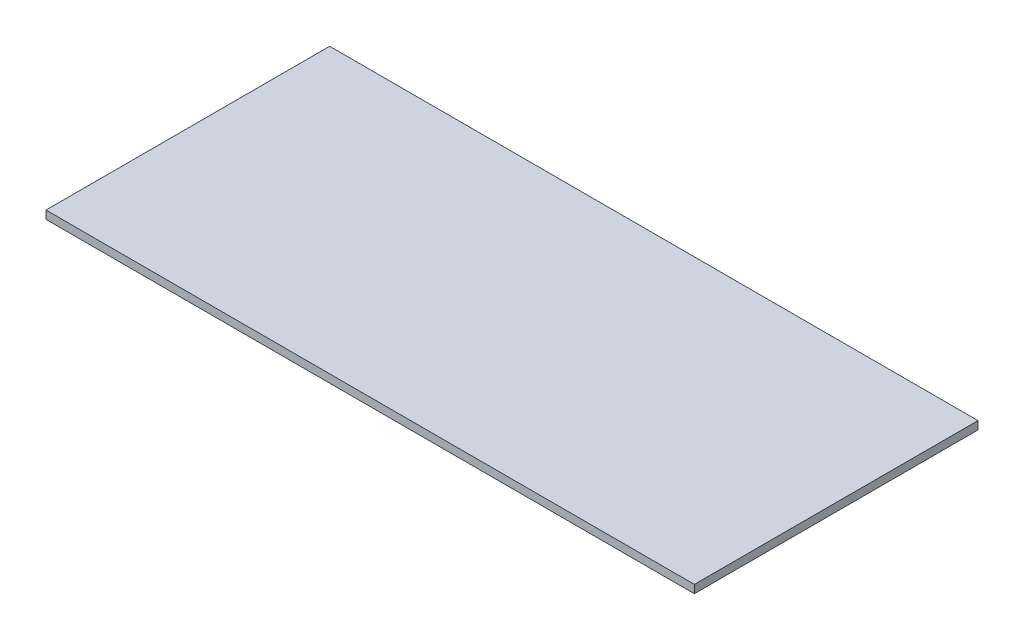
ISO-10303-21;
HEADER;
FILE_DESCRIPTION(('STEP AP214'),'2;1');
FILE_NAME('part.step','',(''),(''),'','','');
FILE_SCHEMA(('AUTOMOTIVE_DESIGN { 1 0 10303 214 1 1 1 1 }'));
ENDSEC;
DATA;
#1=APPLICATION_CONTEXT('core data for automotive mechanical design processes');
#2=APPLICATION_PROTOCOL_DEFINITION('international standard','automotive_design',2000,#1);
#3=PRODUCT_CONTEXT('',#1,'mechanical');
#4=PRODUCT('Part','Part','',(#3));
#5=PRODUCT_RELATED_PRODUCT_CATEGORY('part','',(#4));
#6=PRODUCT_DEFINITION_FORMATION('','',#4);
#7=PRODUCT_DEFINITION_CONTEXT('part definition',#1,'design');
#8=PRODUCT_DEFINITION('design','',#6,#7);
#9=PRODUCT_DEFINITION_SHAPE('','',#8);
#10=(LENGTH_UNIT() NAMED_UNIT(*) SI_UNIT(.MILLI.,.METRE.));
#11=(NAMED_UNIT(*) PLANE_ANGLE_UNIT() SI_UNIT($,.RADIAN.));
#12=(NAMED_UNIT(*) SI_UNIT($,.STERADIAN.) SOLID_ANGLE_UNIT());
#13=UNCERTAINTY_MEASURE_WITH_UNIT(LENGTH_MEASURE(1.E-05),#10,'distance_accuracy_value','');
#14=(GEOMETRIC_REPRESENTATION_CONTEXT(3) GLOBAL_UNCERTAINTY_ASSIGNED_CONTEXT((#13)) GLOBAL_UNIT_ASSIGNED_CONTEXT((#10,
#11,#12)) REPRESENTATION_CONTEXT('',''));
#15=CARTESIAN_POINT('',(0.,0.,0.));
#16=DIRECTION('',(0.,0.,1.));
#17=DIRECTION('',(1.,0.,0.));
#18=AXIS2_PLACEMENT_3D('',#15,#16,#17);
#19=CARTESIAN_POINT('',(80.,2.,-35.));
#20=DIRECTION('',(-1.,0.,0.));
#21=DIRECTION('',(0.,0.,1.));
#22=AXIS2_PLACEMENT_3D('',#19,#20,#21);
#23=PLANE('',#22);
#24=DIRECTION('',(0.,0.,-1.));
#25=VECTOR('',#24,1.);
#26=CARTESIAN_POINT('',(80.,0.,-35.));
#27=LINE('',#26,#25);
#28=CARTESIAN_POINT('',(80.,0.,35.));
#29=VERTEX_POINT('',#28);
#30=CARTESIAN_POINT('',(80.,0.,-35.));
#31=VERTEX_POINT('',#30);
#32=EDGE_CURVE('E96',#29,#31,#27,.T.);
#33=ORIENTED_EDGE('',*,*,#32,.T.);
#34=DIRECTION('',(0.,-1.,0.));
#35=VECTOR('',#34,1.);
#36=CARTESIAN_POINT('',(80.,2.,-35.));
#37=LINE('',#36,#35);
#38=CARTESIAN_POINT('',(80.,2.,-35.));
#39=VERTEX_POINT('',#38);
#40=EDGE_CURVE('E11',#39,#31,#37,.T.);
#41=ORIENTED_EDGE('',*,*,#40,.F.);
#42=DIRECTION('',(0.,0.,-1.));
#43=VECTOR('',#42,1.);
#44=CARTESIAN_POINT('',(80.,2.,-35.));
#45=LINE('',#44,#43);
#46=CARTESIAN_POINT('',(80.,2.,35.));
#47=VERTEX_POINT('',#46);
#48=EDGE_CURVE('E84',#47,#39,#45,.T.);
#49=ORIENTED_EDGE('',*,*,#48,.F.);
#50=DIRECTION('',(0.,-1.,0.));
#51=VECTOR('',#50,1.);
#52=CARTESIAN_POINT('',(80.,2.,35.));
#53=LINE('',#52,#51);
#54=EDGE_CURVE('E92',#47,#29,#53,.T.);
#55=ORIENTED_EDGE('',*,*,#54,.T.);
#56=EDGE_LOOP('',(#33,#41,#49,#55));
#57=FACE_BOUND('',#56,.T.);
#58=ADVANCED_FACE('F33',(#57),#23,.F.);
#59=CARTESIAN_POINT('',(-80.,2.,-35.));
#60=DIRECTION('',(0.,0.,1.));
#61=DIRECTION('',(1.,0.,0.));
#62=AXIS2_PLACEMENT_3D('',#59,#60,#61);
#63=PLANE('',#62);
#64=DIRECTION('',(-1.,0.,0.));
#65=VECTOR('',#64,1.);
#66=CARTESIAN_POINT('',(-80.,0.,-35.));
#67=LINE('',#66,#65);
#68=CARTESIAN_POINT('',(-80.,0.,-35.));
#69=VERTEX_POINT('',#68);
#70=EDGE_CURVE('E88',#31,#69,#67,.T.);
#71=ORIENTED_EDGE('',*,*,#70,.T.);
#72=DIRECTION('',(0.,-1.,0.));
#73=VECTOR('',#72,1.);
#74=CARTESIAN_POINT('',(-80.,2.,-35.));
#75=LINE('',#74,#73);
#76=CARTESIAN_POINT('',(-80.,2.,-35.));
#77=VERTEX_POINT('',#76);
#78=EDGE_CURVE('E41',#77,#69,#75,.T.);
#79=ORIENTED_EDGE('',*,*,#78,.F.);
#80=DIRECTION('',(-1.,0.,0.));
#81=VECTOR('',#80,1.);
#82=CARTESIAN_POINT('',(-80.,2.,-35.));
#83=LINE('',#82,#81);
#84=EDGE_CURVE('E79',#39,#77,#83,.T.);
#85=ORIENTED_EDGE('',*,*,#84,.F.);
#86=ORIENTED_EDGE('',*,*,#40,.T.);
#87=EDGE_LOOP('',(#71,#79,#85,#86));
#88=FACE_BOUND('',#87,.T.);
#89=ADVANCED_FACE('F87',(#88),#63,.F.);
#90=CARTESIAN_POINT('',(-80.,2.,-35.));
#91=DIRECTION('',(1.,0.,0.));
#92=DIRECTION('',(0.,0.,-1.));
#93=AXIS2_PLACEMENT_3D('',#90,#91,#92);
#94=PLANE('',#93);
#95=DIRECTION('',(0.,0.,1.));
#96=VECTOR('',#95,1.);
#97=CARTESIAN_POINT('',(-80.,0.,-35.));
#98=LINE('',#97,#96);
#99=CARTESIAN_POINT('',(-80.,0.,35.));
#100=VERTEX_POINT('',#99);
#101=EDGE_CURVE('E66',#69,#100,#98,.T.);
#102=ORIENTED_EDGE('',*,*,#101,.T.);
#103=DIRECTION('',(0.,-1.,0.));
#104=VECTOR('',#103,1.);
#105=CARTESIAN_POINT('',(-80.,2.,35.));
#106=LINE('',#105,#104);
#107=CARTESIAN_POINT('',(-80.,2.,35.));
#108=VERTEX_POINT('',#107);
#109=EDGE_CURVE('E89',#108,#100,#106,.T.);
#110=ORIENTED_EDGE('',*,*,#109,.F.);
#111=DIRECTION('',(0.,0.,1.));
#112=VECTOR('',#111,1.);
#113=CARTESIAN_POINT('',(-80.,2.,-35.));
#114=LINE('',#113,#112);
#115=EDGE_CURVE('E82',#77,#108,#114,.T.);
#116=ORIENTED_EDGE('',*,*,#115,.F.);
#117=ORIENTED_EDGE('',*,*,#78,.T.);
#118=EDGE_LOOP('',(#102,#110,#116,#117));
#119=FACE_BOUND('',#118,.T.);
#120=ADVANCED_FACE('F90',(#119),#94,.F.);
#121=CARTESIAN_POINT('',(-80.,2.,35.));
#122=DIRECTION('',(0.,0.,-1.));
#123=DIRECTION('',(-1.,0.,0.));
#124=AXIS2_PLACEMENT_3D('',#121,#122,#123);
#125=PLANE('',#124);
#126=DIRECTION('',(1.,0.,0.));
#127=VECTOR('',#126,1.);
#128=CARTESIAN_POINT('',(-80.,0.,35.));
#129=LINE('',#128,#127);
#130=EDGE_CURVE('E72',#100,#29,#129,.T.);
#131=ORIENTED_EDGE('',*,*,#130,.T.);
#132=ORIENTED_EDGE('',*,*,#54,.F.);
#133=DIRECTION('',(1.,0.,0.));
#134=VECTOR('',#133,1.);
#135=CARTESIAN_POINT('',(-80.,2.,35.));
#136=LINE('',#135,#134);
#137=EDGE_CURVE('E49',#108,#47,#136,.T.);
#138=ORIENTED_EDGE('',*,*,#137,.F.);
#139=ORIENTED_EDGE('',*,*,#109,.T.);
#140=EDGE_LOOP('',(#131,#132,#138,#139));
#141=FACE_BOUND('',#140,.T.);
#142=ADVANCED_FACE('F103',(#141),#125,.F.);
#143=CARTESIAN_POINT('',(0.,2.,0.));
#144=DIRECTION('',(0.,1.,0.));
#145=DIRECTION('',(0.,0.,1.));
#146=AXIS2_PLACEMENT_3D('',#143,#144,#145);
#147=PLANE('',#146);
#148=ORIENTED_EDGE('',*,*,#48,.T.);
#149=ORIENTED_EDGE('',*,*,#84,.T.);
#150=ORIENTED_EDGE('',*,*,#115,.T.);
#151=ORIENTED_EDGE('',*,*,#137,.T.);
#152=EDGE_LOOP('',(#148,#149,#150,#151));
#153=FACE_BOUND('',#152,.T.);
#154=ADVANCED_FACE('F80',(#153),#147,.T.);
#155=CARTESIAN_POINT('',(0.,0.,0.));
#156=DIRECTION('',(0.,1.,0.));
#157=DIRECTION('',(0.,0.,1.));
#158=AXIS2_PLACEMENT_3D('',#155,#156,#157);
#159=PLANE('',#158);
#160=ORIENTED_EDGE('',*,*,#32,.F.);
#161=ORIENTED_EDGE('',*,*,#130,.F.);
#162=ORIENTED_EDGE('',*,*,#101,.F.);
#163=ORIENTED_EDGE('',*,*,#70,.F.);
#164=EDGE_LOOP('',(#160,#161,#162,#163));
#165=FACE_BOUND('',#164,.T.);
#166=ADVANCED_FACE('F106',(#165),#159,.F.);
#167=CLOSED_SHELL('',(#58,#89,#120,#142,#154,#166));
#168=MANIFOLD_SOLID_BREP('B2',#167);
#169=ADVANCED_BREP_SHAPE_REPRESENTATION('',(#18,#168),#14);
#170=SHAPE_DEFINITION_REPRESENTATION(#9,#169);
ENDSEC;
END-ISO-10303-21;
